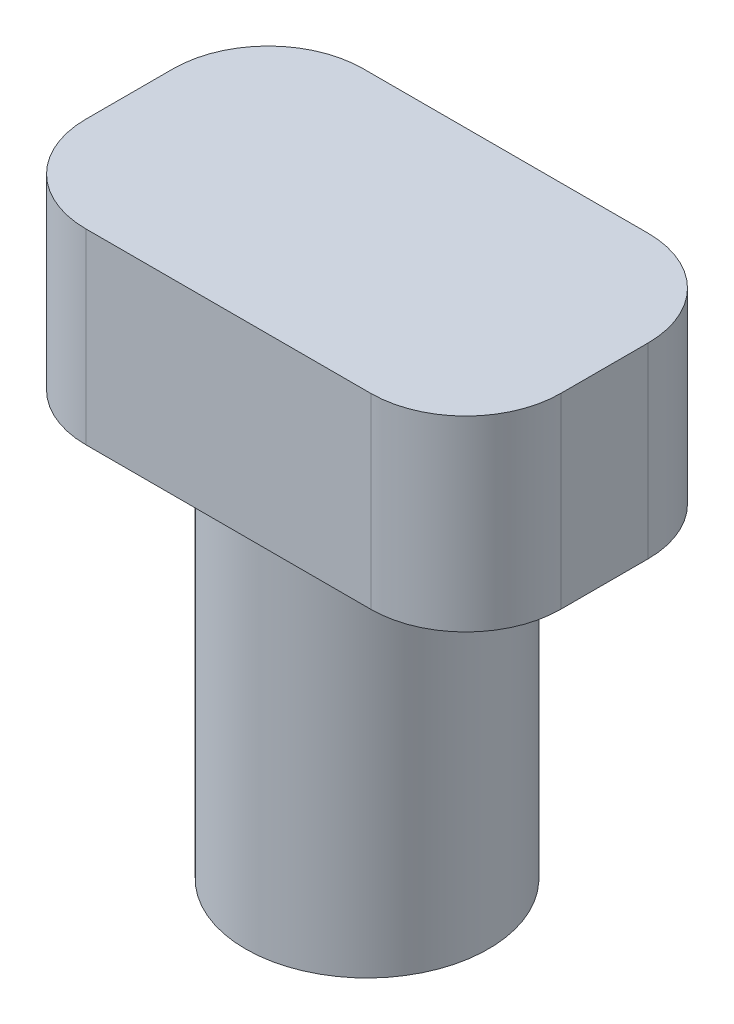
ISO-10303-21;
HEADER;
FILE_DESCRIPTION(('STEP AP214'),'2;1');
FILE_NAME('part.step','',(''),(''),'','','');
FILE_SCHEMA(('AUTOMOTIVE_DESIGN { 1 0 10303 214 1 1 1 1 }'));
ENDSEC;
DATA;
#1=APPLICATION_CONTEXT('core data for automotive mechanical design processes');
#2=APPLICATION_PROTOCOL_DEFINITION('international standard','automotive_design',2000,#1);
#3=PRODUCT_CONTEXT('',#1,'mechanical');
#4=PRODUCT('Part','Part','',(#3));
#5=PRODUCT_RELATED_PRODUCT_CATEGORY('part','',(#4));
#6=PRODUCT_DEFINITION_FORMATION('','',#4);
#7=PRODUCT_DEFINITION_CONTEXT('part definition',#1,'design');
#8=PRODUCT_DEFINITION('design','',#6,#7);
#9=PRODUCT_DEFINITION_SHAPE('','',#8);
#10=(LENGTH_UNIT() NAMED_UNIT(*) SI_UNIT(.MILLI.,.METRE.));
#11=(NAMED_UNIT(*) PLANE_ANGLE_UNIT() SI_UNIT($,.RADIAN.));
#12=(NAMED_UNIT(*) SI_UNIT($,.STERADIAN.) SOLID_ANGLE_UNIT());
#13=UNCERTAINTY_MEASURE_WITH_UNIT(LENGTH_MEASURE(1.E-05),#10,'distance_accuracy_value','');
#14=(GEOMETRIC_REPRESENTATION_CONTEXT(3) GLOBAL_UNCERTAINTY_ASSIGNED_CONTEXT((#13)) GLOBAL_UNIT_ASSIGNED_CONTEXT((#10,
#11,#12)) REPRESENTATION_CONTEXT('',''));
#15=CARTESIAN_POINT('',(0.,0.,0.));
#16=DIRECTION('',(0.,0.,1.));
#17=DIRECTION('',(1.,0.,0.));
#18=AXIS2_PLACEMENT_3D('',#15,#16,#17);
#19=CARTESIAN_POINT('',(0.,10.,0.));
#20=DIRECTION('',(0.,-1.,0.));
#21=DIRECTION('',(0.,0.,-1.));
#22=AXIS2_PLACEMENT_3D('',#19,#20,#21);
#23=CYLINDRICAL_SURFACE('',#22,3.25);
#24=CARTESIAN_POINT('',(0.,10.,0.));
#25=DIRECTION('',(0.,1.,0.));
#26=DIRECTION('',(0.,0.,1.));
#27=AXIS2_PLACEMENT_3D('',#24,#25,#26);
#28=CIRCLE('',#27,3.25);
#29=CARTESIAN_POINT('',(0.,10.,3.25));
#30=VERTEX_POINT('',#29);
#31=EDGE_CURVE('E160',#30,#30,#28,.T.);
#32=ORIENTED_EDGE('',*,*,#31,.F.);
#33=EDGE_LOOP('',(#32));
#34=FACE_BOUND('',#33,.T.);
#35=CARTESIAN_POINT('',(0.,0.,0.));
#36=DIRECTION('',(0.,1.,0.));
#37=DIRECTION('',(0.,0.,1.));
#38=AXIS2_PLACEMENT_3D('',#35,#36,#37);
#39=CIRCLE('',#38,3.25);
#40=CARTESIAN_POINT('',(0.,0.,3.25));
#41=VERTEX_POINT('',#40);
#42=EDGE_CURVE('E154',#41,#41,#39,.T.);
#43=ORIENTED_EDGE('',*,*,#42,.T.);
#44=EDGE_LOOP('',(#43));
#45=FACE_BOUND('',#44,.T.);
#46=ADVANCED_FACE('F45',(#34,#45),#23,.T.);
#47=CARTESIAN_POINT('',(0.,0.,0.));
#48=DIRECTION('',(0.,1.,0.));
#49=DIRECTION('',(0.,0.,1.));
#50=AXIS2_PLACEMENT_3D('',#47,#48,#49);
#51=PLANE('',#50);
#52=CARTESIAN_POINT('',(0.,0.,0.));
#53=DIRECTION('',(0.,-1.,0.));
#54=DIRECTION('',(0.,0.,-1.));
#55=AXIS2_PLACEMENT_3D('',#52,#53,#54);
#56=CIRCLE('',#55,1.75);
#57=CARTESIAN_POINT('',(0.,0.,-1.75));
#58=VERTEX_POINT('',#57);
#59=EDGE_CURVE('E155',#58,#58,#56,.T.);
#60=ORIENTED_EDGE('',*,*,#59,.F.);
#61=EDGE_LOOP('',(#60));
#62=FACE_BOUND('',#61,.T.);
#63=ORIENTED_EDGE('',*,*,#42,.F.);
#64=EDGE_LOOP('',(#63));
#65=FACE_BOUND('',#64,.T.);
#66=ADVANCED_FACE('F238',(#62,#65),#51,.F.);
#67=CARTESIAN_POINT('',(0.,2.5,0.));
#68=DIRECTION('',(0.,-1.,0.));
#69=DIRECTION('',(0.,0.,-1.));
#70=AXIS2_PLACEMENT_3D('',#67,#68,#69);
#71=CYLINDRICAL_SURFACE('',#70,1.75);
#72=CARTESIAN_POINT('',(0.,2.5,0.));
#73=DIRECTION('',(0.,-1.,0.));
#74=DIRECTION('',(0.,0.,-1.));
#75=AXIS2_PLACEMENT_3D('',#72,#73,#74);
#76=CIRCLE('',#75,1.75);
#77=CARTESIAN_POINT('',(0.,2.5,-1.75));
#78=VERTEX_POINT('',#77);
#79=EDGE_CURVE('E150',#78,#78,#76,.T.);
#80=ORIENTED_EDGE('',*,*,#79,.F.);
#81=EDGE_LOOP('',(#80));
#82=FACE_BOUND('',#81,.T.);
#83=ORIENTED_EDGE('',*,*,#59,.T.);
#84=EDGE_LOOP('',(#83));
#85=FACE_BOUND('',#84,.T.);
#86=ADVANCED_FACE('F244',(#82,#85),#71,.F.);
#87=CARTESIAN_POINT('',(0.,2.5,0.));
#88=DIRECTION('',(0.,-1.,0.));
#89=DIRECTION('',(0.,0.,-1.));
#90=AXIS2_PLACEMENT_3D('',#87,#88,#89);
#91=PLANE('',#90);
#92=ORIENTED_EDGE('',*,*,#79,.T.);
#93=EDGE_LOOP('',(#92));
#94=FACE_BOUND('',#93,.T.);
#95=ADVANCED_FACE('F322',(#94),#91,.T.);
#96=CARTESIAN_POINT('',(6.35,15.,-3.7084));
#97=DIRECTION('',(-1.,0.,0.));
#98=DIRECTION('',(0.,0.,1.));
#99=AXIS2_PLACEMENT_3D('',#96,#97,#98);
#100=PLANE('',#99);
#101=DIRECTION('',(0.,0.,-1.));
#102=VECTOR('',#101,1.);
#103=CARTESIAN_POINT('',(6.35,10.,-3.7084));
#104=LINE('',#103,#102);
#105=CARTESIAN_POINT('',(6.35,10.,1.1684));
#106=VERTEX_POINT('',#105);
#107=CARTESIAN_POINT('',(6.35,10.,-1.1684));
#108=VERTEX_POINT('',#107);
#109=EDGE_CURVE('E146',#106,#108,#104,.T.);
#110=ORIENTED_EDGE('',*,*,#109,.T.);
#111=DIRECTION('',(0.,-1.,0.));
#112=VECTOR('',#111,1.);
#113=CARTESIAN_POINT('',(6.35,15.,-1.1684));
#114=LINE('',#113,#112);
#115=CARTESIAN_POINT('',(6.35,15.,-1.1684));
#116=VERTEX_POINT('',#115);
#117=EDGE_CURVE('E196',#108,#116,#114,.F.);
#118=ORIENTED_EDGE('',*,*,#117,.T.);
#119=DIRECTION('',(0.,0.,-1.));
#120=VECTOR('',#119,1.);
#121=CARTESIAN_POINT('',(6.35,15.,-3.7084));
#122=LINE('',#121,#120);
#123=CARTESIAN_POINT('',(6.35,15.,1.1684));
#124=VERTEX_POINT('',#123);
#125=EDGE_CURVE('E144',#124,#116,#122,.T.);
#126=ORIENTED_EDGE('',*,*,#125,.F.);
#127=DIRECTION('',(0.,-1.,0.));
#128=VECTOR('',#127,1.);
#129=CARTESIAN_POINT('',(6.35,15.,1.1684));
#130=LINE('',#129,#128);
#131=EDGE_CURVE('E192',#124,#106,#130,.T.);
#132=ORIENTED_EDGE('',*,*,#131,.T.);
#133=EDGE_LOOP('',(#110,#118,#126,#132));
#134=FACE_BOUND('',#133,.T.);
#135=ADVANCED_FACE('F211',(#134),#100,.F.);
#136=CARTESIAN_POINT('',(-6.35,15.,-3.7084));
#137=DIRECTION('',(0.,0.,1.));
#138=DIRECTION('',(1.,0.,0.));
#139=AXIS2_PLACEMENT_3D('',#136,#137,#138);
#140=PLANE('',#139);
#141=DIRECTION('',(-1.,0.,0.));
#142=VECTOR('',#141,1.);
#143=CARTESIAN_POINT('',(-6.35,10.,-3.7084));
#144=LINE('',#143,#142);
#145=CARTESIAN_POINT('',(3.81,10.,-3.7084));
#146=VERTEX_POINT('',#145);
#147=CARTESIAN_POINT('',(-3.81,10.,-3.7084));
#148=VERTEX_POINT('',#147);
#149=EDGE_CURVE('E140',#146,#148,#144,.T.);
#150=ORIENTED_EDGE('',*,*,#149,.T.);
#151=DIRECTION('',(0.,-1.,0.));
#152=VECTOR('',#151,1.);
#153=CARTESIAN_POINT('',(-3.81,15.,-3.7084));
#154=LINE('',#153,#152);
#155=CARTESIAN_POINT('',(-3.81,15.,-3.7084));
#156=VERTEX_POINT('',#155);
#157=EDGE_CURVE('E116',#148,#156,#154,.F.);
#158=ORIENTED_EDGE('',*,*,#157,.T.);
#159=DIRECTION('',(-1.,0.,0.));
#160=VECTOR('',#159,1.);
#161=CARTESIAN_POINT('',(-6.35,15.,-3.7084));
#162=LINE('',#161,#160);
#163=CARTESIAN_POINT('',(3.81,15.,-3.7084));
#164=VERTEX_POINT('',#163);
#165=EDGE_CURVE('E216',#164,#156,#162,.T.);
#166=ORIENTED_EDGE('',*,*,#165,.F.);
#167=DIRECTION('',(0.,-1.,0.));
#168=VECTOR('',#167,1.);
#169=CARTESIAN_POINT('',(3.81,15.,-3.7084));
#170=LINE('',#169,#168);
#171=EDGE_CURVE('E122',#164,#146,#170,.T.);
#172=ORIENTED_EDGE('',*,*,#171,.T.);
#173=EDGE_LOOP('',(#150,#158,#166,#172));
#174=FACE_BOUND('',#173,.T.);
#175=ADVANCED_FACE('F304',(#174),#140,.F.);
#176=CARTESIAN_POINT('',(-6.35,15.,-3.7084));
#177=DIRECTION('',(1.,0.,0.));
#178=DIRECTION('',(0.,0.,-1.));
#179=AXIS2_PLACEMENT_3D('',#176,#177,#178);
#180=PLANE('',#179);
#181=DIRECTION('',(0.,0.,1.));
#182=VECTOR('',#181,1.);
#183=CARTESIAN_POINT('',(-6.35,15.,-3.7084));
#184=LINE('',#183,#182);
#185=CARTESIAN_POINT('',(-6.35,15.,-1.1684));
#186=VERTEX_POINT('',#185);
#187=CARTESIAN_POINT('',(-6.35,15.,1.1684));
#188=VERTEX_POINT('',#187);
#189=EDGE_CURVE('E131',#186,#188,#184,.T.);
#190=ORIENTED_EDGE('',*,*,#189,.F.);
#191=DIRECTION('',(0.,-1.,0.));
#192=VECTOR('',#191,1.);
#193=CARTESIAN_POINT('',(-6.35,15.,-1.1684));
#194=LINE('',#193,#192);
#195=CARTESIAN_POINT('',(-6.35,10.,-1.1684));
#196=VERTEX_POINT('',#195);
#197=EDGE_CURVE('E115',#186,#196,#194,.T.);
#198=ORIENTED_EDGE('',*,*,#197,.T.);
#199=DIRECTION('',(0.,0.,1.));
#200=VECTOR('',#199,1.);
#201=CARTESIAN_POINT('',(-6.35,10.,-3.7084));
#202=LINE('',#201,#200);
#203=CARTESIAN_POINT('',(-6.35,10.,1.1684));
#204=VERTEX_POINT('',#203);
#205=EDGE_CURVE('E129',#196,#204,#202,.T.);
#206=ORIENTED_EDGE('',*,*,#205,.T.);
#207=DIRECTION('',(0.,-1.,0.));
#208=VECTOR('',#207,1.);
#209=CARTESIAN_POINT('',(-6.35,15.,1.1684));
#210=LINE('',#209,#208);
#211=EDGE_CURVE('E134',#204,#188,#210,.F.);
#212=ORIENTED_EDGE('',*,*,#211,.T.);
#213=EDGE_LOOP('',(#190,#198,#206,#212));
#214=FACE_BOUND('',#213,.T.);
#215=ADVANCED_FACE('F128',(#214),#180,.F.);
#216=CARTESIAN_POINT('',(-6.35,15.,3.7084));
#217=DIRECTION('',(0.,0.,-1.));
#218=DIRECTION('',(-1.,0.,0.));
#219=AXIS2_PLACEMENT_3D('',#216,#217,#218);
#220=PLANE('',#219);
#221=DIRECTION('',(1.,0.,0.));
#222=VECTOR('',#221,1.);
#223=CARTESIAN_POINT('',(-6.35,10.,3.7084));
#224=LINE('',#223,#222);
#225=CARTESIAN_POINT('',(-3.81,10.,3.7084));
#226=VERTEX_POINT('',#225);
#227=CARTESIAN_POINT('',(3.81,10.,3.7084));
#228=VERTEX_POINT('',#227);
#229=EDGE_CURVE('E139',#226,#228,#224,.T.);
#230=ORIENTED_EDGE('',*,*,#229,.T.);
#231=DIRECTION('',(0.,-1.,0.));
#232=VECTOR('',#231,1.);
#233=CARTESIAN_POINT('',(3.81,15.,3.7084));
#234=LINE('',#233,#232);
#235=CARTESIAN_POINT('',(3.81,15.,3.7084));
#236=VERTEX_POINT('',#235);
#237=EDGE_CURVE('E11',#228,#236,#234,.F.);
#238=ORIENTED_EDGE('',*,*,#237,.T.);
#239=DIRECTION('',(1.,0.,0.));
#240=VECTOR('',#239,1.);
#241=CARTESIAN_POINT('',(-6.35,15.,3.7084));
#242=LINE('',#241,#240);
#243=CARTESIAN_POINT('',(-3.81,15.,3.7084));
#244=VERTEX_POINT('',#243);
#245=EDGE_CURVE('E159',#244,#236,#242,.T.);
#246=ORIENTED_EDGE('',*,*,#245,.F.);
#247=DIRECTION('',(0.,-1.,0.));
#248=VECTOR('',#247,1.);
#249=CARTESIAN_POINT('',(-3.81,15.,3.7084));
#250=LINE('',#249,#248);
#251=EDGE_CURVE('E54',#244,#226,#250,.T.);
#252=ORIENTED_EDGE('',*,*,#251,.T.);
#253=EDGE_LOOP('',(#230,#238,#246,#252));
#254=FACE_BOUND('',#253,.T.);
#255=ADVANCED_FACE('F201',(#254),#220,.F.);
#256=CARTESIAN_POINT('',(0.,15.,0.));
#257=DIRECTION('',(0.,1.,0.));
#258=DIRECTION('',(0.,0.,1.));
#259=AXIS2_PLACEMENT_3D('',#256,#257,#258);
#260=PLANE('',#259);
#261=ORIENTED_EDGE('',*,*,#165,.T.);
#262=CARTESIAN_POINT('',(-3.81,15.,-1.1684));
#263=DIRECTION('',(0.,1.,0.));
#264=DIRECTION('',(0.,0.,1.));
#265=AXIS2_PLACEMENT_3D('',#262,#263,#264);
#266=CIRCLE('',#265,2.54);
#267=EDGE_CURVE('E189',#156,#186,#266,.T.);
#268=ORIENTED_EDGE('',*,*,#267,.T.);
#269=ORIENTED_EDGE('',*,*,#189,.T.);
#270=CARTESIAN_POINT('',(-3.81,15.,1.1684));
#271=DIRECTION('',(0.,1.,0.));
#272=DIRECTION('',(0.,0.,1.));
#273=AXIS2_PLACEMENT_3D('',#270,#271,#272);
#274=CIRCLE('',#273,2.54);
#275=EDGE_CURVE('E66',#188,#244,#274,.T.);
#276=ORIENTED_EDGE('',*,*,#275,.T.);
#277=ORIENTED_EDGE('',*,*,#245,.T.);
#278=CARTESIAN_POINT('',(3.81,15.,1.1684));
#279=DIRECTION('',(0.,1.,0.));
#280=DIRECTION('',(0.,0.,1.));
#281=AXIS2_PLACEMENT_3D('',#278,#279,#280);
#282=CIRCLE('',#281,2.54);
#283=EDGE_CURVE('E183',#236,#124,#282,.T.);
#284=ORIENTED_EDGE('',*,*,#283,.T.);
#285=ORIENTED_EDGE('',*,*,#125,.T.);
#286=CARTESIAN_POINT('',(3.81,15.,-1.1684));
#287=DIRECTION('',(0.,1.,0.));
#288=DIRECTION('',(0.,0.,1.));
#289=AXIS2_PLACEMENT_3D('',#286,#287,#288);
#290=CIRCLE('',#289,2.54);
#291=EDGE_CURVE('E186',#116,#164,#290,.T.);
#292=ORIENTED_EDGE('',*,*,#291,.T.);
#293=EDGE_LOOP('',(#261,#268,#269,#276,#277,#284,#285,#292));
#294=FACE_BOUND('',#293,.T.);
#295=ADVANCED_FACE('F226',(#294),#260,.T.);
#296=CARTESIAN_POINT('',(0.,10.,0.));
#297=DIRECTION('',(0.,1.,0.));
#298=DIRECTION('',(0.,0.,1.));
#299=AXIS2_PLACEMENT_3D('',#296,#297,#298);
#300=PLANE('',#299);
#301=ORIENTED_EDGE('',*,*,#31,.T.);
#302=EDGE_LOOP('',(#301));
#303=FACE_BOUND('',#302,.T.);
#304=ORIENTED_EDGE('',*,*,#205,.F.);
#305=CARTESIAN_POINT('',(-3.81,10.,-1.1684));
#306=DIRECTION('',(0.,1.,0.));
#307=DIRECTION('',(0.,0.,1.));
#308=AXIS2_PLACEMENT_3D('',#305,#306,#307);
#309=CIRCLE('',#308,2.54);
#310=EDGE_CURVE('E111',#196,#148,#309,.F.);
#311=ORIENTED_EDGE('',*,*,#310,.T.);
#312=ORIENTED_EDGE('',*,*,#149,.F.);
#313=CARTESIAN_POINT('',(3.81,10.,-1.1684));
#314=DIRECTION('',(0.,1.,0.));
#315=DIRECTION('',(0.,0.,1.));
#316=AXIS2_PLACEMENT_3D('',#313,#314,#315);
#317=CIRCLE('',#316,2.54);
#318=EDGE_CURVE('E123',#146,#108,#317,.F.);
#319=ORIENTED_EDGE('',*,*,#318,.T.);
#320=ORIENTED_EDGE('',*,*,#109,.F.);
#321=CARTESIAN_POINT('',(3.81,10.,1.1684));
#322=DIRECTION('',(0.,1.,0.));
#323=DIRECTION('',(0.,0.,1.));
#324=AXIS2_PLACEMENT_3D('',#321,#322,#323);
#325=CIRCLE('',#324,2.54);
#326=EDGE_CURVE('E171',#106,#228,#325,.F.);
#327=ORIENTED_EDGE('',*,*,#326,.T.);
#328=ORIENTED_EDGE('',*,*,#229,.F.);
#329=CARTESIAN_POINT('',(-3.81,10.,1.1684));
#330=DIRECTION('',(0.,1.,0.));
#331=DIRECTION('',(0.,0.,1.));
#332=AXIS2_PLACEMENT_3D('',#329,#330,#331);
#333=CIRCLE('',#332,2.54);
#334=EDGE_CURVE('E133',#226,#204,#333,.F.);
#335=ORIENTED_EDGE('',*,*,#334,.T.);
#336=EDGE_LOOP('',(#304,#311,#312,#319,#320,#327,#328,#335));
#337=FACE_BOUND('',#336,.T.);
#338=ADVANCED_FACE('F136',(#303,#337),#300,.F.);
#339=CARTESIAN_POINT('',(-3.81,15.,-1.1684));
#340=DIRECTION('',(0.,-1.,0.));
#341=DIRECTION('',(0.,0.,-1.));
#342=AXIS2_PLACEMENT_3D('',#339,#340,#341);
#343=CYLINDRICAL_SURFACE('',#342,2.54);
#344=ORIENTED_EDGE('',*,*,#267,.F.);
#345=ORIENTED_EDGE('',*,*,#157,.F.);
#346=ORIENTED_EDGE('',*,*,#310,.F.);
#347=ORIENTED_EDGE('',*,*,#197,.F.);
#348=EDGE_LOOP('',(#344,#345,#346,#347));
#349=FACE_BOUND('',#348,.T.);
#350=ADVANCED_FACE('F114',(#349),#343,.T.);
#351=CARTESIAN_POINT('',(3.81,15.,-1.1684));
#352=DIRECTION('',(0.,-1.,0.));
#353=DIRECTION('',(0.,0.,-1.));
#354=AXIS2_PLACEMENT_3D('',#351,#352,#353);
#355=CYLINDRICAL_SURFACE('',#354,2.54);
#356=ORIENTED_EDGE('',*,*,#291,.F.);
#357=ORIENTED_EDGE('',*,*,#117,.F.);
#358=ORIENTED_EDGE('',*,*,#318,.F.);
#359=ORIENTED_EDGE('',*,*,#171,.F.);
#360=EDGE_LOOP('',(#356,#357,#358,#359));
#361=FACE_BOUND('',#360,.T.);
#362=ADVANCED_FACE('F253',(#361),#355,.T.);
#363=CARTESIAN_POINT('',(3.81,15.,1.1684));
#364=DIRECTION('',(0.,-1.,0.));
#365=DIRECTION('',(0.,0.,-1.));
#366=AXIS2_PLACEMENT_3D('',#363,#364,#365);
#367=CYLINDRICAL_SURFACE('',#366,2.54);
#368=ORIENTED_EDGE('',*,*,#283,.F.);
#369=ORIENTED_EDGE('',*,*,#237,.F.);
#370=ORIENTED_EDGE('',*,*,#326,.F.);
#371=ORIENTED_EDGE('',*,*,#131,.F.);
#372=EDGE_LOOP('',(#368,#369,#370,#371));
#373=FACE_BOUND('',#372,.T.);
#374=ADVANCED_FACE('F208',(#373),#367,.T.);
#375=CARTESIAN_POINT('',(-3.81,15.,1.1684));
#376=DIRECTION('',(0.,-1.,0.));
#377=DIRECTION('',(0.,0.,-1.));
#378=AXIS2_PLACEMENT_3D('',#375,#376,#377);
#379=CYLINDRICAL_SURFACE('',#378,2.54);
#380=ORIENTED_EDGE('',*,*,#275,.F.);
#381=ORIENTED_EDGE('',*,*,#211,.F.);
#382=ORIENTED_EDGE('',*,*,#334,.F.);
#383=ORIENTED_EDGE('',*,*,#251,.F.);
#384=EDGE_LOOP('',(#380,#381,#382,#383));
#385=FACE_BOUND('',#384,.T.);
#386=ADVANCED_FACE('F47',(#385),#379,.T.);
#387=CLOSED_SHELL('',(#46,#66,#86,#95,#135,#175,#215,#255,#295,#338,#350,#362,#374,#386));
#388=MANIFOLD_SOLID_BREP('B2',#387);
#389=ADVANCED_BREP_SHAPE_REPRESENTATION('',(#18,#388),#14);
#390=SHAPE_DEFINITION_REPRESENTATION(#9,#389);
ENDSEC;
END-ISO-10303-21;
